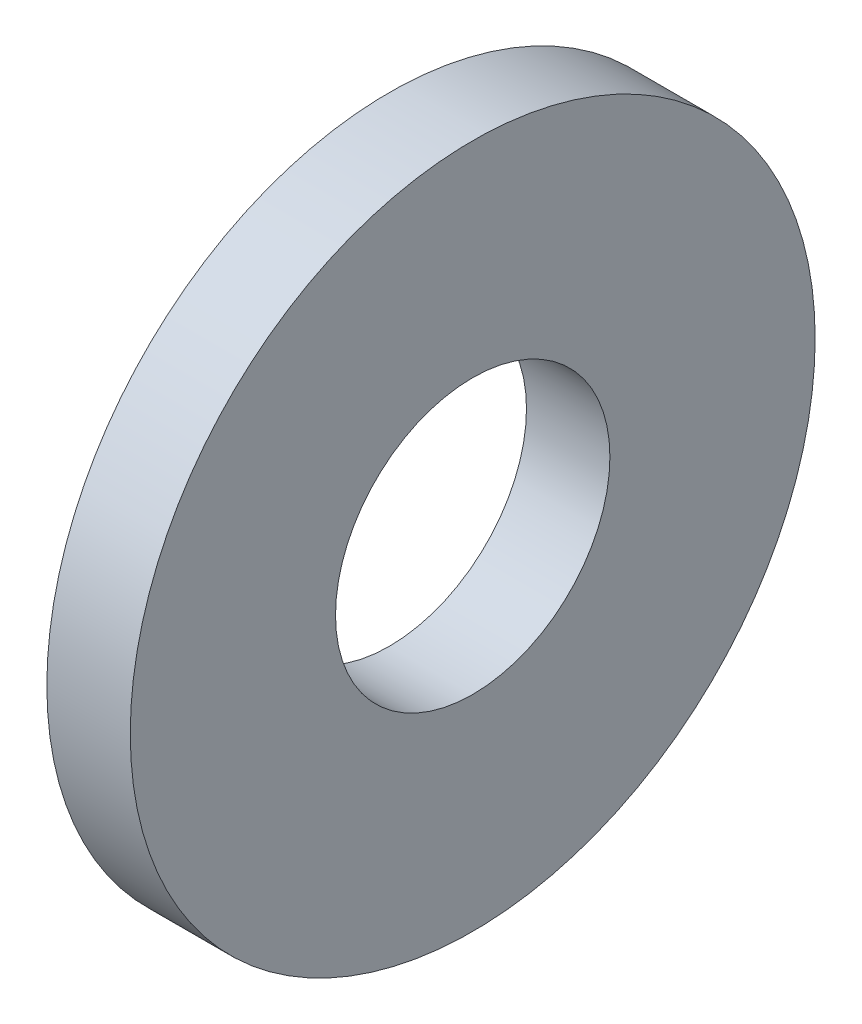
ISO-10303-21;
HEADER;
FILE_DESCRIPTION(('STEP AP214'),'2;1');
FILE_NAME('part.step','',(''),(''),'','','');
FILE_SCHEMA(('AUTOMOTIVE_DESIGN { 1 0 10303 214 1 1 1 1 }'));
ENDSEC;
DATA;
#1=APPLICATION_CONTEXT('core data for automotive mechanical design processes');
#2=APPLICATION_PROTOCOL_DEFINITION('international standard','automotive_design',2000,#1);
#3=PRODUCT_CONTEXT('',#1,'mechanical');
#4=PRODUCT('Part','Part','',(#3));
#5=PRODUCT_RELATED_PRODUCT_CATEGORY('part','',(#4));
#6=PRODUCT_DEFINITION_FORMATION('','',#4);
#7=PRODUCT_DEFINITION_CONTEXT('part definition',#1,'design');
#8=PRODUCT_DEFINITION('design','',#6,#7);
#9=PRODUCT_DEFINITION_SHAPE('','',#8);
#10=(LENGTH_UNIT() NAMED_UNIT(*) SI_UNIT(.MILLI.,.METRE.));
#11=(NAMED_UNIT(*) PLANE_ANGLE_UNIT() SI_UNIT($,.RADIAN.));
#12=(NAMED_UNIT(*) SI_UNIT($,.STERADIAN.) SOLID_ANGLE_UNIT());
#13=UNCERTAINTY_MEASURE_WITH_UNIT(LENGTH_MEASURE(1.E-05),#10,'distance_accuracy_value','');
#14=(GEOMETRIC_REPRESENTATION_CONTEXT(3) GLOBAL_UNCERTAINTY_ASSIGNED_CONTEXT((#13)) GLOBAL_UNIT_ASSIGNED_CONTEXT((#10,
#11,#12)) REPRESENTATION_CONTEXT('',''));
#15=CARTESIAN_POINT('',(0.,0.,0.));
#16=DIRECTION('',(0.,0.,1.));
#17=DIRECTION('',(1.,0.,0.));
#18=AXIS2_PLACEMENT_3D('',#15,#16,#17);
#19=CARTESIAN_POINT('',(0.9652,0.,0.));
#20=DIRECTION('',(1.,0.,0.));
#21=DIRECTION('',(0.,0.,-1.));
#22=AXIS2_PLACEMENT_3D('',#19,#20,#21);
#23=PLANE('',#22);
#24=CARTESIAN_POINT('',(0.9652,0.,0.));
#25=DIRECTION('',(1.,0.,0.));
#26=DIRECTION('',(0.,0.,-1.));
#27=AXIS2_PLACEMENT_3D('',#24,#25,#26);
#28=CIRCLE('',#27,3.9624);
#29=CARTESIAN_POINT('',(0.9652,0.,-3.9624));
#30=VERTEX_POINT('',#29);
#31=EDGE_CURVE('E10',#30,#30,#28,.T.);
#32=ORIENTED_EDGE('',*,*,#31,.T.);
#33=EDGE_LOOP('',(#32));
#34=FACE_BOUND('',#33,.T.);
#35=CARTESIAN_POINT('',(0.9652,0.,0.));
#36=DIRECTION('',(1.,0.,0.));
#37=DIRECTION('',(0.,0.,-1.));
#38=AXIS2_PLACEMENT_3D('',#35,#36,#37);
#39=CIRCLE('',#38,1.5875);
#40=CARTESIAN_POINT('',(0.9652,0.,-1.5875));
#41=VERTEX_POINT('',#40);
#42=EDGE_CURVE('E43',#41,#41,#39,.T.);
#43=ORIENTED_EDGE('',*,*,#42,.F.);
#44=EDGE_LOOP('',(#43));
#45=FACE_BOUND('',#44,.T.);
#46=ADVANCED_FACE('F32',(#34,#45),#23,.T.);
#47=CARTESIAN_POINT('',(0.,0.,0.));
#48=DIRECTION('',(1.,0.,0.));
#49=DIRECTION('',(0.,0.,-1.));
#50=AXIS2_PLACEMENT_3D('',#47,#48,#49);
#51=PLANE('',#50);
#52=CARTESIAN_POINT('',(0.,0.,0.));
#53=DIRECTION('',(1.,0.,0.));
#54=DIRECTION('',(0.,0.,-1.));
#55=AXIS2_PLACEMENT_3D('',#52,#53,#54);
#56=CIRCLE('',#55,3.9624);
#57=CARTESIAN_POINT('',(0.,0.,-3.9624));
#58=VERTEX_POINT('',#57);
#59=EDGE_CURVE('E36',#58,#58,#56,.T.);
#60=ORIENTED_EDGE('',*,*,#59,.F.);
#61=EDGE_LOOP('',(#60));
#62=FACE_BOUND('',#61,.T.);
#63=CARTESIAN_POINT('',(0.,0.,0.));
#64=DIRECTION('',(1.,0.,0.));
#65=DIRECTION('',(0.,0.,-1.));
#66=AXIS2_PLACEMENT_3D('',#63,#64,#65);
#67=CIRCLE('',#66,1.5875);
#68=CARTESIAN_POINT('',(0.,0.,-1.5875));
#69=VERTEX_POINT('',#68);
#70=EDGE_CURVE('E45',#69,#69,#67,.T.);
#71=ORIENTED_EDGE('',*,*,#70,.T.);
#72=EDGE_LOOP('',(#71));
#73=FACE_BOUND('',#72,.T.);
#74=ADVANCED_FACE('F55',(#62,#73),#51,.F.);
#75=CARTESIAN_POINT('',(0.9652,0.,0.));
#76=DIRECTION('',(-1.,0.,0.));
#77=DIRECTION('',(0.,0.,1.));
#78=AXIS2_PLACEMENT_3D('',#75,#76,#77);
#79=CYLINDRICAL_SURFACE('',#78,3.9624);
#80=ORIENTED_EDGE('',*,*,#31,.F.);
#81=EDGE_LOOP('',(#80));
#82=FACE_BOUND('',#81,.T.);
#83=ORIENTED_EDGE('',*,*,#59,.T.);
#84=EDGE_LOOP('',(#83));
#85=FACE_BOUND('',#84,.T.);
#86=ADVANCED_FACE('F34',(#82,#85),#79,.T.);
#87=CARTESIAN_POINT('',(0.9652,0.,0.));
#88=DIRECTION('',(-1.,0.,0.));
#89=DIRECTION('',(0.,0.,1.));
#90=AXIS2_PLACEMENT_3D('',#87,#88,#89);
#91=CYLINDRICAL_SURFACE('',#90,1.5875);
#92=ORIENTED_EDGE('',*,*,#42,.T.);
#93=EDGE_LOOP('',(#92));
#94=FACE_BOUND('',#93,.T.);
#95=ORIENTED_EDGE('',*,*,#70,.F.);
#96=EDGE_LOOP('',(#95));
#97=FACE_BOUND('',#96,.T.);
#98=ADVANCED_FACE('F51',(#94,#97),#91,.F.);
#99=CLOSED_SHELL('',(#46,#74,#86,#98));
#100=MANIFOLD_SOLID_BREP('B2',#99);
#101=ADVANCED_BREP_SHAPE_REPRESENTATION('',(#18,#100),#14);
#102=SHAPE_DEFINITION_REPRESENTATION(#9,#101);
ENDSEC;
END-ISO-10303-21;
